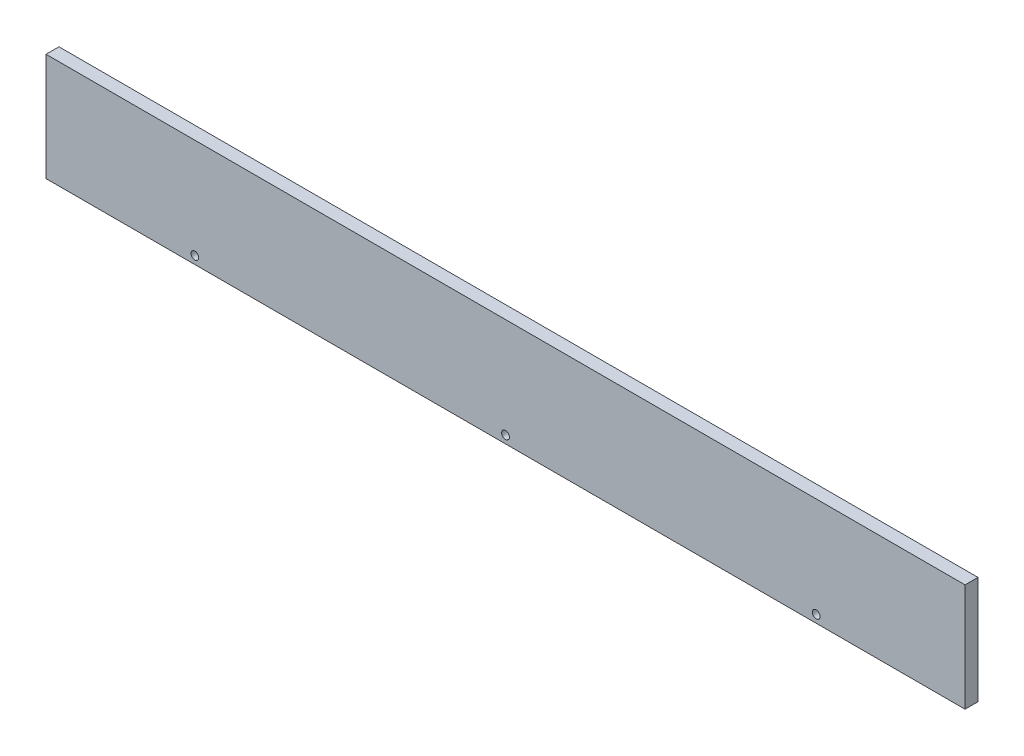
ISO-10303-21;
HEADER;
FILE_DESCRIPTION(('STEP AP214'),'2;1');
FILE_NAME('part.step','',(''),(''),'','','');
FILE_SCHEMA(('AUTOMOTIVE_DESIGN { 1 0 10303 214 1 1 1 1 }'));
ENDSEC;
DATA;
#1=APPLICATION_CONTEXT('core data for automotive mechanical design processes');
#2=APPLICATION_PROTOCOL_DEFINITION('international standard','automotive_design',2000,#1);
#3=PRODUCT_CONTEXT('',#1,'mechanical');
#4=PRODUCT('Part','Part','',(#3));
#5=PRODUCT_RELATED_PRODUCT_CATEGORY('part','',(#4));
#6=PRODUCT_DEFINITION_FORMATION('','',#4);
#7=PRODUCT_DEFINITION_CONTEXT('part definition',#1,'design');
#8=PRODUCT_DEFINITION('design','',#6,#7);
#9=PRODUCT_DEFINITION_SHAPE('','',#8);
#10=(LENGTH_UNIT() NAMED_UNIT(*) SI_UNIT(.MILLI.,.METRE.));
#11=(NAMED_UNIT(*) PLANE_ANGLE_UNIT() SI_UNIT($,.RADIAN.));
#12=(NAMED_UNIT(*) SI_UNIT($,.STERADIAN.) SOLID_ANGLE_UNIT());
#13=UNCERTAINTY_MEASURE_WITH_UNIT(LENGTH_MEASURE(1.E-05),#10,'distance_accuracy_value','');
#14=(GEOMETRIC_REPRESENTATION_CONTEXT(3) GLOBAL_UNCERTAINTY_ASSIGNED_CONTEXT((#13)) GLOBAL_UNIT_ASSIGNED_CONTEXT((#10,
#11,#12)) REPRESENTATION_CONTEXT('',''));
#15=CARTESIAN_POINT('',(0.,0.,0.));
#16=DIRECTION('',(0.,0.,1.));
#17=DIRECTION('',(1.,0.,0.));
#18=AXIS2_PLACEMENT_3D('',#15,#16,#17);
#19=CARTESIAN_POINT('',(0.,0.,6.35));
#20=DIRECTION('',(1.,0.,0.));
#21=DIRECTION('',(0.,1.,0.));
#22=AXIS2_PLACEMENT_3D('',#19,#20,#21);
#23=PLANE('',#22);
#24=DIRECTION('',(0.,-1.,0.));
#25=VECTOR('',#24,1.);
#26=CARTESIAN_POINT('',(0.,0.,0.));
#27=LINE('',#26,#25);
#28=CARTESIAN_POINT('',(0.,0.,0.));
#29=VERTEX_POINT('',#28);
#30=CARTESIAN_POINT('',(0.,-52.832,0.));
#31=VERTEX_POINT('',#30);
#32=EDGE_CURVE('E97',#29,#31,#27,.T.);
#33=ORIENTED_EDGE('',*,*,#32,.T.);
#34=DIRECTION('',(0.,0.,-1.));
#35=VECTOR('',#34,1.);
#36=CARTESIAN_POINT('',(0.,-52.832,6.35));
#37=LINE('',#36,#35);
#38=CARTESIAN_POINT('',(0.,-52.832,6.35));
#39=VERTEX_POINT('',#38);
#40=EDGE_CURVE('E11',#39,#31,#37,.T.);
#41=ORIENTED_EDGE('',*,*,#40,.F.);
#42=DIRECTION('',(0.,-1.,0.));
#43=VECTOR('',#42,1.);
#44=CARTESIAN_POINT('',(0.,0.,6.35));
#45=LINE('',#44,#43);
#46=CARTESIAN_POINT('',(0.,0.,6.35));
#47=VERTEX_POINT('',#46);
#48=EDGE_CURVE('E85',#47,#39,#45,.T.);
#49=ORIENTED_EDGE('',*,*,#48,.F.);
#50=DIRECTION('',(0.,0.,-1.));
#51=VECTOR('',#50,1.);
#52=CARTESIAN_POINT('',(0.,0.,6.35));
#53=LINE('',#52,#51);
#54=EDGE_CURVE('E93',#47,#29,#53,.T.);
#55=ORIENTED_EDGE('',*,*,#54,.T.);
#56=EDGE_LOOP('',(#33,#41,#49,#55));
#57=FACE_BOUND('',#56,.T.);
#58=ADVANCED_FACE('F34',(#57),#23,.F.);
#59=CARTESIAN_POINT('',(0.,-52.832,6.35));
#60=DIRECTION('',(0.,1.,0.));
#61=DIRECTION('',(0.,0.,1.));
#62=AXIS2_PLACEMENT_3D('',#59,#60,#61);
#63=PLANE('',#62);
#64=DIRECTION('',(1.,0.,0.));
#65=VECTOR('',#64,1.);
#66=CARTESIAN_POINT('',(0.,-52.832,0.));
#67=LINE('',#66,#65);
#68=CARTESIAN_POINT('',(450.85,-52.832,0.));
#69=VERTEX_POINT('',#68);
#70=EDGE_CURVE('E89',#31,#69,#67,.T.);
#71=ORIENTED_EDGE('',*,*,#70,.T.);
#72=DIRECTION('',(0.,0.,-1.));
#73=VECTOR('',#72,1.);
#74=CARTESIAN_POINT('',(450.85,-52.832,6.35));
#75=LINE('',#74,#73);
#76=CARTESIAN_POINT('',(450.85,-52.832,6.35));
#77=VERTEX_POINT('',#76);
#78=EDGE_CURVE('E42',#77,#69,#75,.T.);
#79=ORIENTED_EDGE('',*,*,#78,.F.);
#80=DIRECTION('',(1.,0.,0.));
#81=VECTOR('',#80,1.);
#82=CARTESIAN_POINT('',(0.,-52.832,6.35));
#83=LINE('',#82,#81);
#84=EDGE_CURVE('E80',#39,#77,#83,.T.);
#85=ORIENTED_EDGE('',*,*,#84,.F.);
#86=ORIENTED_EDGE('',*,*,#40,.T.);
#87=EDGE_LOOP('',(#71,#79,#85,#86));
#88=FACE_BOUND('',#87,.T.);
#89=ADVANCED_FACE('F88',(#88),#63,.F.);
#90=CARTESIAN_POINT('',(450.85,0.,6.35));
#91=DIRECTION('',(-1.,0.,0.));
#92=DIRECTION('',(0.,0.,1.));
#93=AXIS2_PLACEMENT_3D('',#90,#91,#92);
#94=PLANE('',#93);
#95=DIRECTION('',(0.,1.,0.));
#96=VECTOR('',#95,1.);
#97=CARTESIAN_POINT('',(450.85,0.,0.));
#98=LINE('',#97,#96);
#99=CARTESIAN_POINT('',(450.85,0.,0.));
#100=VERTEX_POINT('',#99);
#101=EDGE_CURVE('E67',#69,#100,#98,.T.);
#102=ORIENTED_EDGE('',*,*,#101,.T.);
#103=DIRECTION('',(0.,0.,-1.));
#104=VECTOR('',#103,1.);
#105=CARTESIAN_POINT('',(450.85,0.,6.35));
#106=LINE('',#105,#104);
#107=CARTESIAN_POINT('',(450.85,0.,6.35));
#108=VERTEX_POINT('',#107);
#109=EDGE_CURVE('E90',#108,#100,#106,.T.);
#110=ORIENTED_EDGE('',*,*,#109,.F.);
#111=DIRECTION('',(0.,1.,0.));
#112=VECTOR('',#111,1.);
#113=CARTESIAN_POINT('',(450.85,0.,6.35));
#114=LINE('',#113,#112);
#115=EDGE_CURVE('E83',#77,#108,#114,.T.);
#116=ORIENTED_EDGE('',*,*,#115,.F.);
#117=ORIENTED_EDGE('',*,*,#78,.T.);
#118=EDGE_LOOP('',(#102,#110,#116,#117));
#119=FACE_BOUND('',#118,.T.);
#120=ADVANCED_FACE('F91',(#119),#94,.F.);
#121=CARTESIAN_POINT('',(0.,0.,6.35));
#122=DIRECTION('',(0.,-1.,0.));
#123=DIRECTION('',(0.,0.,-1.));
#124=AXIS2_PLACEMENT_3D('',#121,#122,#123);
#125=PLANE('',#124);
#126=DIRECTION('',(-1.,0.,0.));
#127=VECTOR('',#126,1.);
#128=CARTESIAN_POINT('',(0.,0.,0.));
#129=LINE('',#128,#127);
#130=EDGE_CURVE('E73',#100,#29,#129,.T.);
#131=ORIENTED_EDGE('',*,*,#130,.T.);
#132=ORIENTED_EDGE('',*,*,#54,.F.);
#133=DIRECTION('',(-1.,0.,0.));
#134=VECTOR('',#133,1.);
#135=CARTESIAN_POINT('',(0.,0.,6.35));
#136=LINE('',#135,#134);
#137=EDGE_CURVE('E50',#108,#47,#136,.T.);
#138=ORIENTED_EDGE('',*,*,#137,.F.);
#139=ORIENTED_EDGE('',*,*,#109,.T.);
#140=EDGE_LOOP('',(#131,#132,#138,#139));
#141=FACE_BOUND('',#140,.T.);
#142=ADVANCED_FACE('F105',(#141),#125,.F.);
#143=CARTESIAN_POINT('',(0.,0.,6.35));
#144=DIRECTION('',(0.,0.,1.));
#145=DIRECTION('',(1.,0.,0.));
#146=AXIS2_PLACEMENT_3D('',#143,#144,#145);
#147=PLANE('',#146);
#148=CARTESIAN_POINT('',(377.825,-49.022,6.35));
#149=DIRECTION('',(0.,0.,1.));
#150=DIRECTION('',(1.,0.,0.));
#151=AXIS2_PLACEMENT_3D('',#148,#149,#150);
#152=CIRCLE('',#151,1.90499999999999);
#153=CARTESIAN_POINT('',(379.73,-49.022,6.35));
#154=VERTEX_POINT('',#153);
#155=EDGE_CURVE('E123',#154,#154,#152,.T.);
#156=ORIENTED_EDGE('',*,*,#155,.F.);
#157=EDGE_LOOP('',(#156));
#158=FACE_BOUND('',#157,.T.);
#159=CARTESIAN_POINT('',(225.425,-49.022,6.35));
#160=DIRECTION('',(0.,0.,1.));
#161=DIRECTION('',(1.,0.,0.));
#162=AXIS2_PLACEMENT_3D('',#159,#160,#161);
#163=CIRCLE('',#162,1.90499999999999);
#164=CARTESIAN_POINT('',(227.33,-49.022,6.35));
#165=VERTEX_POINT('',#164);
#166=EDGE_CURVE('E117',#165,#165,#163,.T.);
#167=ORIENTED_EDGE('',*,*,#166,.F.);
#168=EDGE_LOOP('',(#167));
#169=FACE_BOUND('',#168,.T.);
#170=CARTESIAN_POINT('',(73.025,-49.022,6.35));
#171=DIRECTION('',(0.,0.,1.));
#172=DIRECTION('',(1.,0.,0.));
#173=AXIS2_PLACEMENT_3D('',#170,#171,#172);
#174=CIRCLE('',#173,1.90500000000001);
#175=CARTESIAN_POINT('',(74.93,-49.022,6.35));
#176=VERTEX_POINT('',#175);
#177=EDGE_CURVE('E111',#176,#176,#174,.T.);
#178=ORIENTED_EDGE('',*,*,#177,.F.);
#179=EDGE_LOOP('',(#178));
#180=FACE_BOUND('',#179,.T.);
#181=ORIENTED_EDGE('',*,*,#48,.T.);
#182=ORIENTED_EDGE('',*,*,#84,.T.);
#183=ORIENTED_EDGE('',*,*,#115,.T.);
#184=ORIENTED_EDGE('',*,*,#137,.T.);
#185=EDGE_LOOP('',(#181,#182,#183,#184));
#186=FACE_BOUND('',#185,.T.);
#187=ADVANCED_FACE('F81',(#158,#169,#180,#186),#147,.T.);
#188=CARTESIAN_POINT('',(0.,0.,0.));
#189=DIRECTION('',(0.,0.,1.));
#190=DIRECTION('',(1.,0.,0.));
#191=AXIS2_PLACEMENT_3D('',#188,#189,#190);
#192=PLANE('',#191);
#193=CARTESIAN_POINT('',(377.825,-49.022,0.));
#194=DIRECTION('',(0.,0.,1.));
#195=DIRECTION('',(1.,0.,0.));
#196=AXIS2_PLACEMENT_3D('',#193,#194,#195);
#197=CIRCLE('',#196,1.90499999999999);
#198=CARTESIAN_POINT('',(379.73,-49.022,0.));
#199=VERTEX_POINT('',#198);
#200=EDGE_CURVE('E120',#199,#199,#197,.T.);
#201=ORIENTED_EDGE('',*,*,#200,.T.);
#202=EDGE_LOOP('',(#201));
#203=FACE_BOUND('',#202,.T.);
#204=CARTESIAN_POINT('',(225.425,-49.022,0.));
#205=DIRECTION('',(0.,0.,1.));
#206=DIRECTION('',(1.,0.,0.));
#207=AXIS2_PLACEMENT_3D('',#204,#205,#206);
#208=CIRCLE('',#207,1.90499999999999);
#209=CARTESIAN_POINT('',(227.33,-49.022,0.));
#210=VERTEX_POINT('',#209);
#211=EDGE_CURVE('E114',#210,#210,#208,.T.);
#212=ORIENTED_EDGE('',*,*,#211,.T.);
#213=EDGE_LOOP('',(#212));
#214=FACE_BOUND('',#213,.T.);
#215=CARTESIAN_POINT('',(73.025,-49.022,0.));
#216=DIRECTION('',(0.,0.,1.));
#217=DIRECTION('',(1.,0.,0.));
#218=AXIS2_PLACEMENT_3D('',#215,#216,#217);
#219=CIRCLE('',#218,1.90500000000001);
#220=CARTESIAN_POINT('',(74.93,-49.022,0.));
#221=VERTEX_POINT('',#220);
#222=EDGE_CURVE('E100',#221,#221,#219,.T.);
#223=ORIENTED_EDGE('',*,*,#222,.T.);
#224=EDGE_LOOP('',(#223));
#225=FACE_BOUND('',#224,.T.);
#226=ORIENTED_EDGE('',*,*,#32,.F.);
#227=ORIENTED_EDGE('',*,*,#130,.F.);
#228=ORIENTED_EDGE('',*,*,#101,.F.);
#229=ORIENTED_EDGE('',*,*,#70,.F.);
#230=EDGE_LOOP('',(#226,#227,#228,#229));
#231=FACE_BOUND('',#230,.T.);
#232=ADVANCED_FACE('F108',(#203,#214,#225,#231),#192,.F.);
#233=CARTESIAN_POINT('',(73.025,-49.022,0.));
#234=DIRECTION('',(0.,0.,1.));
#235=DIRECTION('',(1.,0.,0.));
#236=AXIS2_PLACEMENT_3D('',#233,#234,#235);
#237=CYLINDRICAL_SURFACE('',#236,1.90500000000001);
#238=ORIENTED_EDGE('',*,*,#222,.F.);
#239=EDGE_LOOP('',(#238));
#240=FACE_BOUND('',#239,.T.);
#241=ORIENTED_EDGE('',*,*,#177,.T.);
#242=EDGE_LOOP('',(#241));
#243=FACE_BOUND('',#242,.T.);
#244=ADVANCED_FACE('F145',(#240,#243),#237,.F.);
#245=CARTESIAN_POINT('',(225.425,-49.022,0.));
#246=DIRECTION('',(0.,0.,1.));
#247=DIRECTION('',(1.,0.,0.));
#248=AXIS2_PLACEMENT_3D('',#245,#246,#247);
#249=CYLINDRICAL_SURFACE('',#248,1.90499999999999);
#250=ORIENTED_EDGE('',*,*,#211,.F.);
#251=EDGE_LOOP('',(#250));
#252=FACE_BOUND('',#251,.T.);
#253=ORIENTED_EDGE('',*,*,#166,.T.);
#254=EDGE_LOOP('',(#253));
#255=FACE_BOUND('',#254,.T.);
#256=ADVANCED_FACE('F134',(#252,#255),#249,.F.);
#257=CARTESIAN_POINT('',(377.825,-49.022,0.));
#258=DIRECTION('',(0.,0.,1.));
#259=DIRECTION('',(1.,0.,0.));
#260=AXIS2_PLACEMENT_3D('',#257,#258,#259);
#261=CYLINDRICAL_SURFACE('',#260,1.90499999999999);
#262=ORIENTED_EDGE('',*,*,#200,.F.);
#263=EDGE_LOOP('',(#262));
#264=FACE_BOUND('',#263,.T.);
#265=ORIENTED_EDGE('',*,*,#155,.T.);
#266=EDGE_LOOP('',(#265));
#267=FACE_BOUND('',#266,.T.);
#268=ADVANCED_FACE('F131',(#264,#267),#261,.F.);
#269=CLOSED_SHELL('',(#58,#89,#120,#142,#187,#232,#244,#256,#268));
#270=MANIFOLD_SOLID_BREP('B2',#269);
#271=ADVANCED_BREP_SHAPE_REPRESENTATION('',(#18,#270),#14);
#272=SHAPE_DEFINITION_REPRESENTATION(#9,#271);
ENDSEC;
END-ISO-10303-21;
